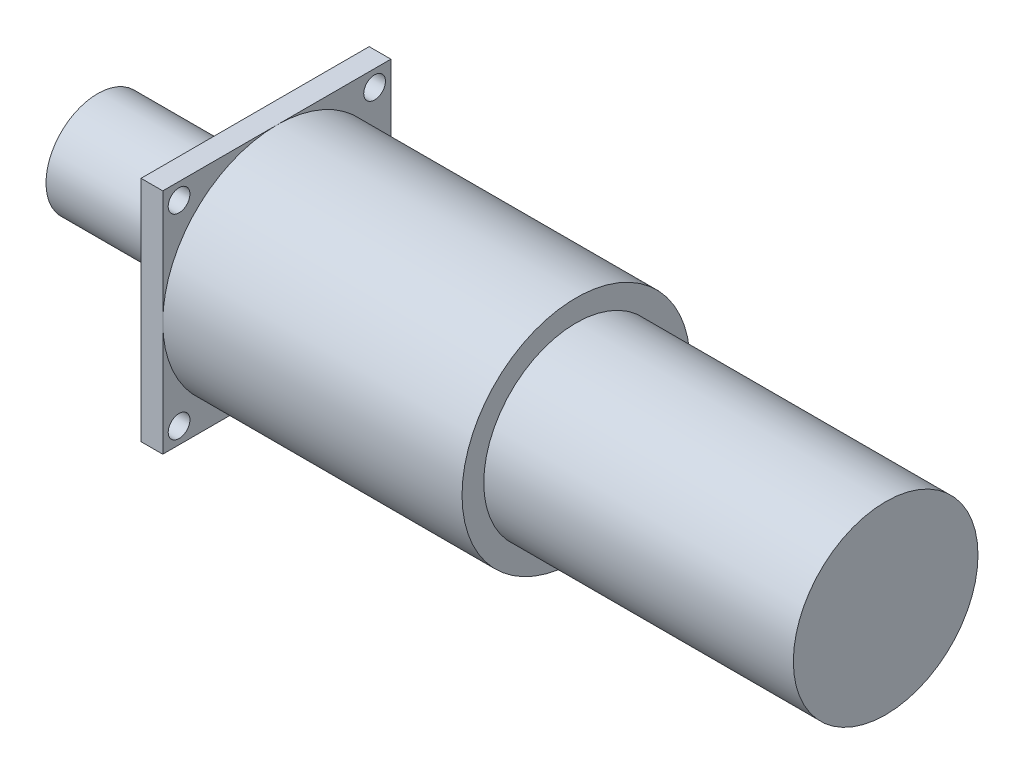
ISO-10303-21;
HEADER;
FILE_DESCRIPTION(('STEP AP214'),'2;1');
FILE_NAME('part.step','',(''),(''),'','','');
FILE_SCHEMA(('AUTOMOTIVE_DESIGN { 1 0 10303 214 1 1 1 1 }'));
ENDSEC;
DATA;
#1=APPLICATION_CONTEXT('core data for automotive mechanical design processes');
#2=APPLICATION_PROTOCOL_DEFINITION('international standard','automotive_design',2000,#1);
#3=PRODUCT_CONTEXT('',#1,'mechanical');
#4=PRODUCT('Part','Part','',(#3));
#5=PRODUCT_RELATED_PRODUCT_CATEGORY('part','',(#4));
#6=PRODUCT_DEFINITION_FORMATION('','',#4);
#7=PRODUCT_DEFINITION_CONTEXT('part definition',#1,'design');
#8=PRODUCT_DEFINITION('design','',#6,#7);
#9=PRODUCT_DEFINITION_SHAPE('','',#8);
#10=(LENGTH_UNIT() NAMED_UNIT(*) SI_UNIT(.MILLI.,.METRE.));
#11=(NAMED_UNIT(*) PLANE_ANGLE_UNIT() SI_UNIT($,.RADIAN.));
#12=(NAMED_UNIT(*) SI_UNIT($,.STERADIAN.) SOLID_ANGLE_UNIT());
#13=UNCERTAINTY_MEASURE_WITH_UNIT(LENGTH_MEASURE(1.E-05),#10,'distance_accuracy_value','');
#14=(GEOMETRIC_REPRESENTATION_CONTEXT(3) GLOBAL_UNCERTAINTY_ASSIGNED_CONTEXT((#13)) GLOBAL_UNIT_ASSIGNED_CONTEXT((#10,
#11,#12)) REPRESENTATION_CONTEXT('',''));
#15=CARTESIAN_POINT('',(0.,0.,0.));
#16=DIRECTION('',(0.,0.,1.));
#17=DIRECTION('',(1.,0.,0.));
#18=AXIS2_PLACEMENT_3D('',#15,#16,#17);
#19=CARTESIAN_POINT('',(-29.,0.,0.));
#20=DIRECTION('',(1.,0.,0.));
#21=DIRECTION('',(0.,0.,-1.));
#22=AXIS2_PLACEMENT_3D('',#19,#20,#21);
#23=PLANE('',#22);
#24=CARTESIAN_POINT('',(-29.,0.,0.));
#25=DIRECTION('',(-1.,0.,0.));
#26=DIRECTION('',(0.,0.,1.));
#27=AXIS2_PLACEMENT_3D('',#24,#25,#26);
#28=CIRCLE('',#27,9.5);
#29=CARTESIAN_POINT('',(-29.,0.,9.5));
#30=VERTEX_POINT('',#29);
#31=EDGE_CURVE('E159',#30,#30,#28,.T.);
#32=ORIENTED_EDGE('',*,*,#31,.T.);
#33=EDGE_LOOP('',(#32));
#34=FACE_BOUND('',#33,.T.);
#35=ADVANCED_FACE('F37',(#34),#23,.F.);
#36=CARTESIAN_POINT('',(0.,0.,0.));
#37=DIRECTION('',(-1.,0.,0.));
#38=DIRECTION('',(0.,0.,1.));
#39=AXIS2_PLACEMENT_3D('',#36,#37,#38);
#40=CYLINDRICAL_SURFACE('',#39,9.5);
#41=ORIENTED_EDGE('',*,*,#31,.F.);
#42=EDGE_LOOP('',(#41));
#43=FACE_BOUND('',#42,.T.);
#44=CARTESIAN_POINT('',(-11.2,0.,0.));
#45=DIRECTION('',(-1.,0.,0.));
#46=DIRECTION('',(0.,0.,1.));
#47=AXIS2_PLACEMENT_3D('',#44,#45,#46);
#48=CIRCLE('',#47,9.5);
#49=CARTESIAN_POINT('',(-11.2,0.,9.5));
#50=VERTEX_POINT('',#49);
#51=EDGE_CURVE('E157',#50,#50,#48,.T.);
#52=ORIENTED_EDGE('',*,*,#51,.T.);
#53=EDGE_LOOP('',(#52));
#54=FACE_BOUND('',#53,.T.);
#55=ADVANCED_FACE('F202',(#43,#54),#40,.T.);
#56=CARTESIAN_POINT('',(-11.2,9.5,0.));
#57=DIRECTION('',(-1.,0.,0.));
#58=DIRECTION('',(0.,0.,1.));
#59=AXIS2_PLACEMENT_3D('',#56,#57,#58);
#60=PLANE('',#59);
#61=ORIENTED_EDGE('',*,*,#51,.F.);
#62=EDGE_LOOP('',(#61));
#63=FACE_BOUND('',#62,.T.);
#64=CARTESIAN_POINT('',(-11.2,0.,0.));
#65=DIRECTION('',(-1.,0.,0.));
#66=DIRECTION('',(0.,0.,1.));
#67=AXIS2_PLACEMENT_3D('',#64,#65,#66);
#68=CIRCLE('',#67,4.);
#69=CARTESIAN_POINT('',(-11.2,0.,4.));
#70=VERTEX_POINT('',#69);
#71=EDGE_CURVE('E154',#70,#70,#68,.T.);
#72=ORIENTED_EDGE('',*,*,#71,.T.);
#73=EDGE_LOOP('',(#72));
#74=FACE_BOUND('',#73,.T.);
#75=ADVANCED_FACE('F206',(#63,#74),#60,.F.);
#76=CARTESIAN_POINT('',(0.,0.,0.));
#77=DIRECTION('',(-1.,0.,0.));
#78=DIRECTION('',(0.,0.,1.));
#79=AXIS2_PLACEMENT_3D('',#76,#77,#78);
#80=CYLINDRICAL_SURFACE('',#79,4.);
#81=ORIENTED_EDGE('',*,*,#71,.F.);
#82=EDGE_LOOP('',(#81));
#83=FACE_BOUND('',#82,.T.);
#84=CARTESIAN_POINT('',(-3.7,0.,0.));
#85=DIRECTION('',(-1.,0.,0.));
#86=DIRECTION('',(0.,0.,1.));
#87=AXIS2_PLACEMENT_3D('',#84,#85,#86);
#88=CIRCLE('',#87,4.);
#89=CARTESIAN_POINT('',(-3.7,0.,4.));
#90=VERTEX_POINT('',#89);
#91=EDGE_CURVE('E151',#90,#90,#88,.T.);
#92=ORIENTED_EDGE('',*,*,#91,.T.);
#93=EDGE_LOOP('',(#92));
#94=FACE_BOUND('',#93,.T.);
#95=ADVANCED_FACE('F211',(#83,#94),#80,.T.);
#96=CARTESIAN_POINT('',(-3.7,15.,0.));
#97=DIRECTION('',(1.,0.,0.));
#98=DIRECTION('',(0.,0.,-1.));
#99=AXIS2_PLACEMENT_3D('',#96,#97,#98);
#100=PLANE('',#99);
#101=ORIENTED_EDGE('',*,*,#91,.F.);
#102=EDGE_LOOP('',(#101));
#103=FACE_BOUND('',#102,.T.);
#104=CARTESIAN_POINT('',(-3.7,0.,0.));
#105=DIRECTION('',(-1.,0.,0.));
#106=DIRECTION('',(0.,0.,1.));
#107=AXIS2_PLACEMENT_3D('',#104,#105,#106);
#108=CIRCLE('',#107,15.);
#109=CARTESIAN_POINT('',(-3.7,0.,15.));
#110=VERTEX_POINT('',#109);
#111=EDGE_CURVE('E148',#110,#110,#108,.T.);
#112=ORIENTED_EDGE('',*,*,#111,.T.);
#113=EDGE_LOOP('',(#112));
#114=FACE_BOUND('',#113,.T.);
#115=ADVANCED_FACE('F218',(#103,#114),#100,.F.);
#116=CARTESIAN_POINT('',(0.,0.,0.));
#117=DIRECTION('',(-1.,0.,0.));
#118=DIRECTION('',(0.,0.,1.));
#119=AXIS2_PLACEMENT_3D('',#116,#117,#118);
#120=CYLINDRICAL_SURFACE('',#119,15.);
#121=ORIENTED_EDGE('',*,*,#111,.F.);
#122=EDGE_LOOP('',(#121));
#123=FACE_BOUND('',#122,.T.);
#124=CARTESIAN_POINT('',(0.,0.,0.));
#125=DIRECTION('',(-1.,0.,0.));
#126=DIRECTION('',(0.,0.,1.));
#127=AXIS2_PLACEMENT_3D('',#124,#125,#126);
#128=CIRCLE('',#127,15.);
#129=CARTESIAN_POINT('',(0.,0.,15.));
#130=VERTEX_POINT('',#129);
#131=EDGE_CURVE('E145',#130,#130,#128,.T.);
#132=ORIENTED_EDGE('',*,*,#131,.T.);
#133=EDGE_LOOP('',(#132));
#134=FACE_BOUND('',#133,.T.);
#135=ADVANCED_FACE('F222',(#123,#134),#120,.T.);
#136=CARTESIAN_POINT('',(0.,15.,0.));
#137=DIRECTION('',(1.,0.,0.));
#138=DIRECTION('',(0.,0.,-1.));
#139=AXIS2_PLACEMENT_3D('',#136,#137,#138);
#140=PLANE('',#139);
#141=CARTESIAN_POINT('',(0.,18.0000000000001,-18.));
#142=DIRECTION('',(1.,0.,0.));
#143=DIRECTION('',(0.,0.,1.));
#144=AXIS2_PLACEMENT_3D('',#141,#142,#143);
#145=CIRCLE('',#144,2.00000000000001);
#146=CARTESIAN_POINT('',(0.,18.0000000000001,-16.));
#147=VERTEX_POINT('',#146);
#148=EDGE_CURVE('E337',#147,#147,#145,.T.);
#149=ORIENTED_EDGE('',*,*,#148,.T.);
#150=EDGE_LOOP('',(#149));
#151=FACE_BOUND('',#150,.T.);
#152=CARTESIAN_POINT('',(0.,-18.0000000000001,-18.));
#153=DIRECTION('',(1.,0.,0.));
#154=DIRECTION('',(0.,0.,-1.));
#155=AXIS2_PLACEMENT_3D('',#152,#153,#154);
#156=CIRCLE('',#155,2.);
#157=CARTESIAN_POINT('',(0.,-18.0000000000001,-20.));
#158=VERTEX_POINT('',#157);
#159=EDGE_CURVE('E343',#158,#158,#156,.T.);
#160=ORIENTED_EDGE('',*,*,#159,.T.);
#161=EDGE_LOOP('',(#160));
#162=FACE_BOUND('',#161,.T.);
#163=CARTESIAN_POINT('',(0.,-18.0000000000001,18.));
#164=DIRECTION('',(1.,0.,0.));
#165=DIRECTION('',(0.,0.,1.));
#166=AXIS2_PLACEMENT_3D('',#163,#164,#165);
#167=CIRCLE('',#166,2.);
#168=CARTESIAN_POINT('',(0.,-18.0000000000001,20.));
#169=VERTEX_POINT('',#168);
#170=EDGE_CURVE('E328',#169,#169,#167,.T.);
#171=ORIENTED_EDGE('',*,*,#170,.T.);
#172=EDGE_LOOP('',(#171));
#173=FACE_BOUND('',#172,.T.);
#174=CARTESIAN_POINT('',(0.,18.0000000000001,18.));
#175=DIRECTION('',(1.,0.,0.));
#176=DIRECTION('',(0.,0.,-1.));
#177=AXIS2_PLACEMENT_3D('',#174,#175,#176);
#178=CIRCLE('',#177,2.00000000000001);
#179=CARTESIAN_POINT('',(0.,18.0000000000001,16.));
#180=VERTEX_POINT('',#179);
#181=EDGE_CURVE('E124',#180,#180,#178,.T.);
#182=ORIENTED_EDGE('',*,*,#181,.T.);
#183=EDGE_LOOP('',(#182));
#184=FACE_BOUND('',#183,.T.);
#185=ORIENTED_EDGE('',*,*,#131,.F.);
#186=EDGE_LOOP('',(#185));
#187=FACE_BOUND('',#186,.T.);
#188=DIRECTION('',(0.,0.,1.));
#189=VECTOR('',#188,1.);
#190=CARTESIAN_POINT('',(0.,-21.,-21.));
#191=LINE('',#190,#189);
#192=CARTESIAN_POINT('',(0.,-21.,-21.));
#193=VERTEX_POINT('',#192);
#194=CARTESIAN_POINT('',(0.,-21.,21.));
#195=VERTEX_POINT('',#194);
#196=EDGE_CURVE('E98',#193,#195,#191,.T.);
#197=ORIENTED_EDGE('',*,*,#196,.T.);
#198=DIRECTION('',(0.,1.,0.));
#199=VECTOR('',#198,1.);
#200=CARTESIAN_POINT('',(0.,21.,21.));
#201=LINE('',#200,#199);
#202=CARTESIAN_POINT('',(0.,21.,21.));
#203=VERTEX_POINT('',#202);
#204=EDGE_CURVE('E122',#195,#203,#201,.T.);
#205=ORIENTED_EDGE('',*,*,#204,.T.);
#206=DIRECTION('',(0.,0.,-1.));
#207=VECTOR('',#206,1.);
#208=CARTESIAN_POINT('',(0.,21.,-21.));
#209=LINE('',#208,#207);
#210=CARTESIAN_POINT('',(0.,21.,-21.));
#211=VERTEX_POINT('',#210);
#212=EDGE_CURVE('E105',#203,#211,#209,.T.);
#213=ORIENTED_EDGE('',*,*,#212,.T.);
#214=DIRECTION('',(0.,-1.,0.));
#215=VECTOR('',#214,1.);
#216=CARTESIAN_POINT('',(0.,21.,-21.));
#217=LINE('',#216,#215);
#218=EDGE_CURVE('E126',#211,#193,#217,.T.);
#219=ORIENTED_EDGE('',*,*,#218,.T.);
#220=EDGE_LOOP('',(#197,#205,#213,#219));
#221=FACE_BOUND('',#220,.T.);
#222=ADVANCED_FACE('F180',(#151,#162,#173,#184,#187,#221),#140,.F.);
#223=CARTESIAN_POINT('',(4.,21.,21.));
#224=DIRECTION('',(0.,0.,1.));
#225=DIRECTION('',(0.,-1.,0.));
#226=AXIS2_PLACEMENT_3D('',#223,#224,#225);
#227=PLANE('',#226);
#228=ORIENTED_EDGE('',*,*,#204,.F.);
#229=DIRECTION('',(-1.,0.,0.));
#230=VECTOR('',#229,1.);
#231=CARTESIAN_POINT('',(4.,-21.,21.));
#232=LINE('',#231,#230);
#233=CARTESIAN_POINT('',(4.,-21.,21.));
#234=VERTEX_POINT('',#233);
#235=EDGE_CURVE('E129',#234,#195,#232,.T.);
#236=ORIENTED_EDGE('',*,*,#235,.F.);
#237=DIRECTION('',(0.,1.,0.));
#238=VECTOR('',#237,1.);
#239=CARTESIAN_POINT('',(4.,21.,21.));
#240=LINE('',#239,#238);
#241=CARTESIAN_POINT('',(4.,0.,21.));
#242=VERTEX_POINT('',#241);
#243=EDGE_CURVE('E95',#234,#242,#240,.T.);
#244=ORIENTED_EDGE('',*,*,#243,.T.);
#245=CARTESIAN_POINT('',(4.,21.,21.));
#246=VERTEX_POINT('',#245);
#247=EDGE_CURVE('E87',#242,#246,#240,.T.);
#248=ORIENTED_EDGE('',*,*,#247,.T.);
#249=DIRECTION('',(-1.,0.,0.));
#250=VECTOR('',#249,1.);
#251=CARTESIAN_POINT('',(4.,21.,21.));
#252=LINE('',#251,#250);
#253=EDGE_CURVE('E91',#246,#203,#252,.T.);
#254=ORIENTED_EDGE('',*,*,#253,.T.);
#255=EDGE_LOOP('',(#228,#236,#244,#248,#254));
#256=FACE_BOUND('',#255,.T.);
#257=ADVANCED_FACE('F90',(#256),#227,.T.);
#258=CARTESIAN_POINT('',(4.,-21.,-21.));
#259=DIRECTION('',(0.,-1.,0.));
#260=DIRECTION('',(0.,0.,-1.));
#261=AXIS2_PLACEMENT_3D('',#258,#259,#260);
#262=PLANE('',#261);
#263=ORIENTED_EDGE('',*,*,#235,.T.);
#264=ORIENTED_EDGE('',*,*,#196,.F.);
#265=DIRECTION('',(-1.,0.,0.));
#266=VECTOR('',#265,1.);
#267=CARTESIAN_POINT('',(4.,-21.,-21.));
#268=LINE('',#267,#266);
#269=CARTESIAN_POINT('',(4.,-21.,-21.));
#270=VERTEX_POINT('',#269);
#271=EDGE_CURVE('E133',#270,#193,#268,.T.);
#272=ORIENTED_EDGE('',*,*,#271,.F.);
#273=DIRECTION('',(0.,0.,1.));
#274=VECTOR('',#273,1.);
#275=CARTESIAN_POINT('',(4.,-21.,-21.));
#276=LINE('',#275,#274);
#277=CARTESIAN_POINT('',(4.,-21.,0.));
#278=VERTEX_POINT('',#277);
#279=EDGE_CURVE('E107',#270,#278,#276,.T.);
#280=ORIENTED_EDGE('',*,*,#279,.T.);
#281=EDGE_CURVE('E119',#278,#234,#276,.T.);
#282=ORIENTED_EDGE('',*,*,#281,.T.);
#283=EDGE_LOOP('',(#263,#264,#272,#280,#282));
#284=FACE_BOUND('',#283,.T.);
#285=ADVANCED_FACE('F182',(#284),#262,.T.);
#286=CARTESIAN_POINT('',(4.,21.,-21.));
#287=DIRECTION('',(0.,0.,-1.));
#288=DIRECTION('',(0.,1.,0.));
#289=AXIS2_PLACEMENT_3D('',#286,#287,#288);
#290=PLANE('',#289);
#291=ORIENTED_EDGE('',*,*,#271,.T.);
#292=ORIENTED_EDGE('',*,*,#218,.F.);
#293=DIRECTION('',(-1.,0.,0.));
#294=VECTOR('',#293,1.);
#295=CARTESIAN_POINT('',(4.,21.,-21.));
#296=LINE('',#295,#294);
#297=CARTESIAN_POINT('',(4.,21.,-21.));
#298=VERTEX_POINT('',#297);
#299=EDGE_CURVE('E106',#298,#211,#296,.T.);
#300=ORIENTED_EDGE('',*,*,#299,.F.);
#301=DIRECTION('',(0.,-1.,0.));
#302=VECTOR('',#301,1.);
#303=CARTESIAN_POINT('',(4.,21.,-21.));
#304=LINE('',#303,#302);
#305=CARTESIAN_POINT('',(4.,0.,-21.));
#306=VERTEX_POINT('',#305);
#307=EDGE_CURVE('E114',#298,#306,#304,.T.);
#308=ORIENTED_EDGE('',*,*,#307,.T.);
#309=EDGE_CURVE('E111',#306,#270,#304,.T.);
#310=ORIENTED_EDGE('',*,*,#309,.T.);
#311=EDGE_LOOP('',(#291,#292,#300,#308,#310));
#312=FACE_BOUND('',#311,.T.);
#313=ADVANCED_FACE('F176',(#312),#290,.T.);
#314=CARTESIAN_POINT('',(4.,21.,-21.));
#315=DIRECTION('',(0.,1.,0.));
#316=DIRECTION('',(0.,0.,1.));
#317=AXIS2_PLACEMENT_3D('',#314,#315,#316);
#318=PLANE('',#317);
#319=ORIENTED_EDGE('',*,*,#299,.T.);
#320=ORIENTED_EDGE('',*,*,#212,.F.);
#321=ORIENTED_EDGE('',*,*,#253,.F.);
#322=DIRECTION('',(0.,0.,-1.));
#323=VECTOR('',#322,1.);
#324=CARTESIAN_POINT('',(4.,21.,-21.));
#325=LINE('',#324,#323);
#326=CARTESIAN_POINT('',(4.,21.,0.));
#327=VERTEX_POINT('',#326);
#328=EDGE_CURVE('E104',#246,#327,#325,.T.);
#329=ORIENTED_EDGE('',*,*,#328,.T.);
#330=EDGE_CURVE('E112',#327,#298,#325,.T.);
#331=ORIENTED_EDGE('',*,*,#330,.T.);
#332=EDGE_LOOP('',(#319,#320,#321,#329,#331));
#333=FACE_BOUND('',#332,.T.);
#334=ADVANCED_FACE('F103',(#333),#318,.T.);
#335=CARTESIAN_POINT('',(4.,0.,0.));
#336=DIRECTION('',(-1.,0.,0.));
#337=DIRECTION('',(0.,0.,1.));
#338=AXIS2_PLACEMENT_3D('',#335,#336,#337);
#339=PLANE('',#338);
#340=CARTESIAN_POINT('',(4.,18.0000000000001,18.));
#341=DIRECTION('',(1.,0.,0.));
#342=DIRECTION('',(0.,0.,-1.));
#343=AXIS2_PLACEMENT_3D('',#340,#341,#342);
#344=CIRCLE('',#343,2.00000000000001);
#345=CARTESIAN_POINT('',(4.,18.0000000000001,16.));
#346=VERTEX_POINT('',#345);
#347=EDGE_CURVE('E327',#346,#346,#344,.T.);
#348=ORIENTED_EDGE('',*,*,#347,.F.);
#349=EDGE_LOOP('',(#348));
#350=FACE_BOUND('',#349,.T.);
#351=ORIENTED_EDGE('',*,*,#247,.F.);
#352=CARTESIAN_POINT('',(4.,0.,0.));
#353=DIRECTION('',(-1.,0.,0.));
#354=DIRECTION('',(0.,0.,1.));
#355=AXIS2_PLACEMENT_3D('',#352,#353,#354);
#356=CIRCLE('',#355,21.);
#357=EDGE_CURVE('E11',#242,#327,#356,.T.);
#358=ORIENTED_EDGE('',*,*,#357,.T.);
#359=ORIENTED_EDGE('',*,*,#328,.F.);
#360=EDGE_LOOP('',(#351,#358,#359));
#361=FACE_BOUND('',#360,.T.);
#362=ADVANCED_FACE('F109',(#350,#361),#339,.F.);
#363=CARTESIAN_POINT('',(4.,18.0000000000001,-18.));
#364=DIRECTION('',(1.,0.,0.));
#365=DIRECTION('',(0.,0.,1.));
#366=AXIS2_PLACEMENT_3D('',#363,#364,#365);
#367=CIRCLE('',#366,2.00000000000001);
#368=CARTESIAN_POINT('',(4.,18.0000000000001,-16.));
#369=VERTEX_POINT('',#368);
#370=EDGE_CURVE('E334',#369,#369,#367,.T.);
#371=ORIENTED_EDGE('',*,*,#370,.F.);
#372=EDGE_LOOP('',(#371));
#373=FACE_BOUND('',#372,.T.);
#374=ORIENTED_EDGE('',*,*,#330,.F.);
#375=EDGE_CURVE('E45',#327,#306,#356,.T.);
#376=ORIENTED_EDGE('',*,*,#375,.T.);
#377=ORIENTED_EDGE('',*,*,#307,.F.);
#378=EDGE_LOOP('',(#374,#376,#377));
#379=FACE_BOUND('',#378,.T.);
#380=ADVANCED_FACE('F171',(#373,#379),#339,.F.);
#381=CARTESIAN_POINT('',(4.,-18.0000000000001,-18.));
#382=DIRECTION('',(1.,0.,0.));
#383=DIRECTION('',(0.,0.,-1.));
#384=AXIS2_PLACEMENT_3D('',#381,#382,#383);
#385=CIRCLE('',#384,2.);
#386=CARTESIAN_POINT('',(4.,-18.0000000000001,-20.));
#387=VERTEX_POINT('',#386);
#388=EDGE_CURVE('E340',#387,#387,#385,.T.);
#389=ORIENTED_EDGE('',*,*,#388,.F.);
#390=EDGE_LOOP('',(#389));
#391=FACE_BOUND('',#390,.T.);
#392=ORIENTED_EDGE('',*,*,#309,.F.);
#393=EDGE_CURVE('E55',#306,#278,#356,.T.);
#394=ORIENTED_EDGE('',*,*,#393,.T.);
#395=ORIENTED_EDGE('',*,*,#279,.F.);
#396=EDGE_LOOP('',(#392,#394,#395));
#397=FACE_BOUND('',#396,.T.);
#398=ADVANCED_FACE('F172',(#391,#397),#339,.F.);
#399=CARTESIAN_POINT('',(4.,-18.0000000000001,18.));
#400=DIRECTION('',(1.,0.,0.));
#401=DIRECTION('',(0.,0.,1.));
#402=AXIS2_PLACEMENT_3D('',#399,#400,#401);
#403=CIRCLE('',#402,2.);
#404=CARTESIAN_POINT('',(4.,-18.0000000000001,20.));
#405=VERTEX_POINT('',#404);
#406=EDGE_CURVE('E331',#405,#405,#403,.T.);
#407=ORIENTED_EDGE('',*,*,#406,.F.);
#408=EDGE_LOOP('',(#407));
#409=FACE_BOUND('',#408,.T.);
#410=ORIENTED_EDGE('',*,*,#281,.F.);
#411=EDGE_CURVE('E40',#278,#242,#356,.T.);
#412=ORIENTED_EDGE('',*,*,#411,.T.);
#413=ORIENTED_EDGE('',*,*,#243,.F.);
#414=EDGE_LOOP('',(#410,#412,#413));
#415=FACE_BOUND('',#414,.T.);
#416=ADVANCED_FACE('F183',(#409,#415),#339,.F.);
#417=CARTESIAN_POINT('',(116.1,17.,0.));
#418=DIRECTION('',(-1.,0.,0.));
#419=DIRECTION('',(0.,0.,1.));
#420=AXIS2_PLACEMENT_3D('',#417,#418,#419);
#421=PLANE('',#420);
#422=CARTESIAN_POINT('',(116.1,0.,0.));
#423=DIRECTION('',(-1.,0.,0.));
#424=DIRECTION('',(0.,0.,1.));
#425=AXIS2_PLACEMENT_3D('',#422,#423,#424);
#426=CIRCLE('',#425,17.);
#427=CARTESIAN_POINT('',(116.1,0.,17.));
#428=VERTEX_POINT('',#427);
#429=EDGE_CURVE('E132',#428,#428,#426,.T.);
#430=ORIENTED_EDGE('',*,*,#429,.F.);
#431=EDGE_LOOP('',(#430));
#432=FACE_BOUND('',#431,.T.);
#433=ADVANCED_FACE('F185',(#432),#421,.F.);
#434=CARTESIAN_POINT('',(0.,0.,0.));
#435=DIRECTION('',(-1.,0.,0.));
#436=DIRECTION('',(0.,0.,1.));
#437=AXIS2_PLACEMENT_3D('',#434,#435,#436);
#438=CYLINDRICAL_SURFACE('',#437,17.);
#439=CARTESIAN_POINT('',(59.1,0.,0.));
#440=DIRECTION('',(-1.,0.,0.));
#441=DIRECTION('',(0.,0.,1.));
#442=AXIS2_PLACEMENT_3D('',#439,#440,#441);
#443=CIRCLE('',#442,17.);
#444=CARTESIAN_POINT('',(59.1,0.,17.));
#445=VERTEX_POINT('',#444);
#446=EDGE_CURVE('E139',#445,#445,#443,.T.);
#447=ORIENTED_EDGE('',*,*,#446,.F.);
#448=EDGE_LOOP('',(#447));
#449=FACE_BOUND('',#448,.T.);
#450=ORIENTED_EDGE('',*,*,#429,.T.);
#451=EDGE_LOOP('',(#450));
#452=FACE_BOUND('',#451,.T.);
#453=ADVANCED_FACE('F192',(#449,#452),#438,.T.);
#454=CARTESIAN_POINT('',(59.1,21.,0.));
#455=DIRECTION('',(-1.,0.,0.));
#456=DIRECTION('',(0.,0.,1.));
#457=AXIS2_PLACEMENT_3D('',#454,#455,#456);
#458=PLANE('',#457);
#459=CARTESIAN_POINT('',(59.1,0.,0.));
#460=DIRECTION('',(-1.,0.,0.));
#461=DIRECTION('',(0.,0.,1.));
#462=AXIS2_PLACEMENT_3D('',#459,#460,#461);
#463=CIRCLE('',#462,21.);
#464=CARTESIAN_POINT('',(59.1,0.,21.));
#465=VERTEX_POINT('',#464);
#466=EDGE_CURVE('E142',#465,#465,#463,.T.);
#467=ORIENTED_EDGE('',*,*,#466,.F.);
#468=EDGE_LOOP('',(#467));
#469=FACE_BOUND('',#468,.T.);
#470=ORIENTED_EDGE('',*,*,#446,.T.);
#471=EDGE_LOOP('',(#470));
#472=FACE_BOUND('',#471,.T.);
#473=ADVANCED_FACE('F234',(#469,#472),#458,.F.);
#474=CARTESIAN_POINT('',(0.,0.,0.));
#475=DIRECTION('',(-1.,0.,0.));
#476=DIRECTION('',(0.,0.,1.));
#477=AXIS2_PLACEMENT_3D('',#474,#475,#476);
#478=CYLINDRICAL_SURFACE('',#477,21.);
#479=ORIENTED_EDGE('',*,*,#466,.T.);
#480=EDGE_LOOP('',(#479));
#481=FACE_BOUND('',#480,.T.);
#482=ORIENTED_EDGE('',*,*,#357,.F.);
#483=ORIENTED_EDGE('',*,*,#411,.F.);
#484=ORIENTED_EDGE('',*,*,#393,.F.);
#485=ORIENTED_EDGE('',*,*,#375,.F.);
#486=EDGE_LOOP('',(#482,#483,#484,#485));
#487=FACE_BOUND('',#486,.T.);
#488=ADVANCED_FACE('F230',(#481,#487),#478,.T.);
#489=CARTESIAN_POINT('',(0.,-18.0000000000001,18.));
#490=DIRECTION('',(1.,0.,0.));
#491=DIRECTION('',(0.,0.,-1.));
#492=AXIS2_PLACEMENT_3D('',#489,#490,#491);
#493=CYLINDRICAL_SURFACE('',#492,2.);
#494=ORIENTED_EDGE('',*,*,#170,.F.);
#495=EDGE_LOOP('',(#494));
#496=FACE_BOUND('',#495,.T.);
#497=ORIENTED_EDGE('',*,*,#406,.T.);
#498=EDGE_LOOP('',(#497));
#499=FACE_BOUND('',#498,.T.);
#500=ADVANCED_FACE('F233',(#496,#499),#493,.F.);
#501=CARTESIAN_POINT('',(0.,-18.0000000000001,-18.));
#502=DIRECTION('',(1.,0.,0.));
#503=DIRECTION('',(0.,0.,-1.));
#504=AXIS2_PLACEMENT_3D('',#501,#502,#503);
#505=CYLINDRICAL_SURFACE('',#504,2.);
#506=ORIENTED_EDGE('',*,*,#159,.F.);
#507=EDGE_LOOP('',(#506));
#508=FACE_BOUND('',#507,.T.);
#509=ORIENTED_EDGE('',*,*,#388,.T.);
#510=EDGE_LOOP('',(#509));
#511=FACE_BOUND('',#510,.T.);
#512=ADVANCED_FACE('F289',(#508,#511),#505,.F.);
#513=CARTESIAN_POINT('',(0.,18.0000000000001,-18.));
#514=DIRECTION('',(1.,0.,0.));
#515=DIRECTION('',(0.,0.,-1.));
#516=AXIS2_PLACEMENT_3D('',#513,#514,#515);
#517=CYLINDRICAL_SURFACE('',#516,2.00000000000001);
#518=ORIENTED_EDGE('',*,*,#148,.F.);
#519=EDGE_LOOP('',(#518));
#520=FACE_BOUND('',#519,.T.);
#521=ORIENTED_EDGE('',*,*,#370,.T.);
#522=EDGE_LOOP('',(#521));
#523=FACE_BOUND('',#522,.T.);
#524=ADVANCED_FACE('F299',(#520,#523),#517,.F.);
#525=CARTESIAN_POINT('',(0.,18.0000000000001,18.));
#526=DIRECTION('',(1.,0.,0.));
#527=DIRECTION('',(0.,0.,-1.));
#528=AXIS2_PLACEMENT_3D('',#525,#526,#527);
#529=CYLINDRICAL_SURFACE('',#528,2.00000000000001);
#530=ORIENTED_EDGE('',*,*,#181,.F.);
#531=EDGE_LOOP('',(#530));
#532=FACE_BOUND('',#531,.T.);
#533=ORIENTED_EDGE('',*,*,#347,.T.);
#534=EDGE_LOOP('',(#533));
#535=FACE_BOUND('',#534,.T.);
#536=ADVANCED_FACE('F309',(#532,#535),#529,.F.);
#537=CLOSED_SHELL('',(#35,#55,#75,#95,#115,#135,#222,#257,#285,#313,#334,#362,#380,#398,#416,
#433,#453,#473,#488,#500,#512,#524,#536));
#538=MANIFOLD_SOLID_BREP('B2',#537);
#539=ADVANCED_BREP_SHAPE_REPRESENTATION('',(#18,#538),#14);
#540=SHAPE_DEFINITION_REPRESENTATION(#9,#539);
ENDSEC;
END-ISO-10303-21;
